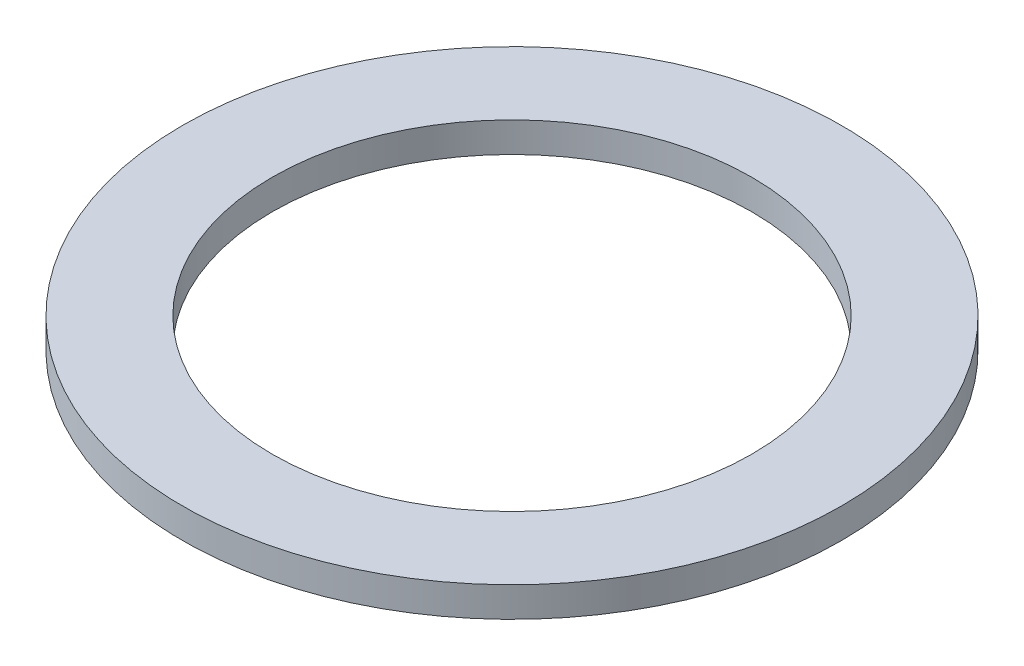
ISO-10303-21;
HEADER;
FILE_DESCRIPTION(('STEP AP214'),'2;1');
FILE_NAME('part.step','',(''),(''),'','','');
FILE_SCHEMA(('AUTOMOTIVE_DESIGN { 1 0 10303 214 1 1 1 1 }'));
ENDSEC;
DATA;
#1=APPLICATION_CONTEXT('core data for automotive mechanical design processes');
#2=APPLICATION_PROTOCOL_DEFINITION('international standard','automotive_design',2000,#1);
#3=PRODUCT_CONTEXT('',#1,'mechanical');
#4=PRODUCT('Part','Part','',(#3));
#5=PRODUCT_RELATED_PRODUCT_CATEGORY('part','',(#4));
#6=PRODUCT_DEFINITION_FORMATION('','',#4);
#7=PRODUCT_DEFINITION_CONTEXT('part definition',#1,'design');
#8=PRODUCT_DEFINITION('design','',#6,#7);
#9=PRODUCT_DEFINITION_SHAPE('','',#8);
#10=(LENGTH_UNIT() NAMED_UNIT(*) SI_UNIT(.MILLI.,.METRE.));
#11=(NAMED_UNIT(*) PLANE_ANGLE_UNIT() SI_UNIT($,.RADIAN.));
#12=(NAMED_UNIT(*) SI_UNIT($,.STERADIAN.) SOLID_ANGLE_UNIT());
#13=UNCERTAINTY_MEASURE_WITH_UNIT(LENGTH_MEASURE(1.E-05),#10,'distance_accuracy_value','');
#14=(GEOMETRIC_REPRESENTATION_CONTEXT(3) GLOBAL_UNCERTAINTY_ASSIGNED_CONTEXT((#13)) GLOBAL_UNIT_ASSIGNED_CONTEXT((#10,
#11,#12)) REPRESENTATION_CONTEXT('',''));
#15=CARTESIAN_POINT('',(0.,0.,0.));
#16=DIRECTION('',(0.,0.,1.));
#17=DIRECTION('',(1.,0.,0.));
#18=AXIS2_PLACEMENT_3D('',#15,#16,#17);
#19=CARTESIAN_POINT('',(0.,0.,0.));
#20=DIRECTION('',(0.,-1.,0.));
#21=DIRECTION('',(1.,0.,0.));
#22=AXIS2_PLACEMENT_3D('',#19,#20,#21);
#23=CYLINDRICAL_SURFACE('',#22,25.4);
#24=CARTESIAN_POINT('',(0.,3.175,0.));
#25=DIRECTION('',(0.,-1.,0.));
#26=DIRECTION('',(1.,0.,0.));
#27=AXIS2_PLACEMENT_3D('',#24,#25,#26);
#28=CIRCLE('',#27,25.4);
#29=CARTESIAN_POINT('',(25.4,3.175,0.));
#30=VERTEX_POINT('',#29);
#31=EDGE_CURVE('E51',#30,#30,#28,.T.);
#32=ORIENTED_EDGE('',*,*,#31,.F.);
#33=EDGE_LOOP('',(#32));
#34=FACE_BOUND('',#33,.T.);
#35=CARTESIAN_POINT('',(0.,0.,0.));
#36=DIRECTION('',(0.,-1.,0.));
#37=DIRECTION('',(1.,0.,0.));
#38=AXIS2_PLACEMENT_3D('',#35,#36,#37);
#39=CIRCLE('',#38,25.4);
#40=CARTESIAN_POINT('',(25.4,0.,0.));
#41=VERTEX_POINT('',#40);
#42=EDGE_CURVE('E10',#41,#41,#39,.T.);
#43=ORIENTED_EDGE('',*,*,#42,.T.);
#44=EDGE_LOOP('',(#43));
#45=FACE_BOUND('',#44,.T.);
#46=ADVANCED_FACE('F37',(#34,#45),#23,.F.);
#47=CARTESIAN_POINT('',(-34.8996,0.,0.));
#48=DIRECTION('',(0.,1.,0.));
#49=DIRECTION('',(-1.,0.,0.));
#50=AXIS2_PLACEMENT_3D('',#47,#48,#49);
#51=PLANE('',#50);
#52=ORIENTED_EDGE('',*,*,#42,.F.);
#53=EDGE_LOOP('',(#52));
#54=FACE_BOUND('',#53,.T.);
#55=CARTESIAN_POINT('',(0.,0.,0.));
#56=DIRECTION('',(0.,-1.,0.));
#57=DIRECTION('',(1.,0.,0.));
#58=AXIS2_PLACEMENT_3D('',#55,#56,#57);
#59=CIRCLE('',#58,34.8996);
#60=CARTESIAN_POINT('',(34.8996,0.,0.));
#61=VERTEX_POINT('',#60);
#62=EDGE_CURVE('E43',#61,#61,#59,.T.);
#63=ORIENTED_EDGE('',*,*,#62,.T.);
#64=EDGE_LOOP('',(#63));
#65=FACE_BOUND('',#64,.T.);
#66=ADVANCED_FACE('F60',(#54,#65),#51,.F.);
#67=CARTESIAN_POINT('',(0.,0.,0.));
#68=DIRECTION('',(0.,-1.,0.));
#69=DIRECTION('',(1.,0.,0.));
#70=AXIS2_PLACEMENT_3D('',#67,#68,#69);
#71=CYLINDRICAL_SURFACE('',#70,34.8996);
#72=ORIENTED_EDGE('',*,*,#62,.F.);
#73=EDGE_LOOP('',(#72));
#74=FACE_BOUND('',#73,.T.);
#75=CARTESIAN_POINT('',(0.,3.175,0.));
#76=DIRECTION('',(0.,-1.,0.));
#77=DIRECTION('',(1.,0.,0.));
#78=AXIS2_PLACEMENT_3D('',#75,#76,#77);
#79=CIRCLE('',#78,34.8996);
#80=CARTESIAN_POINT('',(34.8996,3.175,0.));
#81=VERTEX_POINT('',#80);
#82=EDGE_CURVE('E47',#81,#81,#79,.T.);
#83=ORIENTED_EDGE('',*,*,#82,.T.);
#84=EDGE_LOOP('',(#83));
#85=FACE_BOUND('',#84,.T.);
#86=ADVANCED_FACE('F64',(#74,#85),#71,.T.);
#87=CARTESIAN_POINT('',(-34.8996,3.175,0.));
#88=DIRECTION('',(0.,-1.,0.));
#89=DIRECTION('',(1.,0.,0.));
#90=AXIS2_PLACEMENT_3D('',#87,#88,#89);
#91=PLANE('',#90);
#92=ORIENTED_EDGE('',*,*,#82,.F.);
#93=EDGE_LOOP('',(#92));
#94=FACE_BOUND('',#93,.T.);
#95=ORIENTED_EDGE('',*,*,#31,.T.);
#96=EDGE_LOOP('',(#95));
#97=FACE_BOUND('',#96,.T.);
#98=ADVANCED_FACE('F57',(#94,#97),#91,.F.);
#99=CLOSED_SHELL('',(#46,#66,#86,#98));
#100=MANIFOLD_SOLID_BREP('B2',#99);
#101=ADVANCED_BREP_SHAPE_REPRESENTATION('',(#18,#100),#14);
#102=SHAPE_DEFINITION_REPRESENTATION(#9,#101);
ENDSEC;
END-ISO-10303-21;
